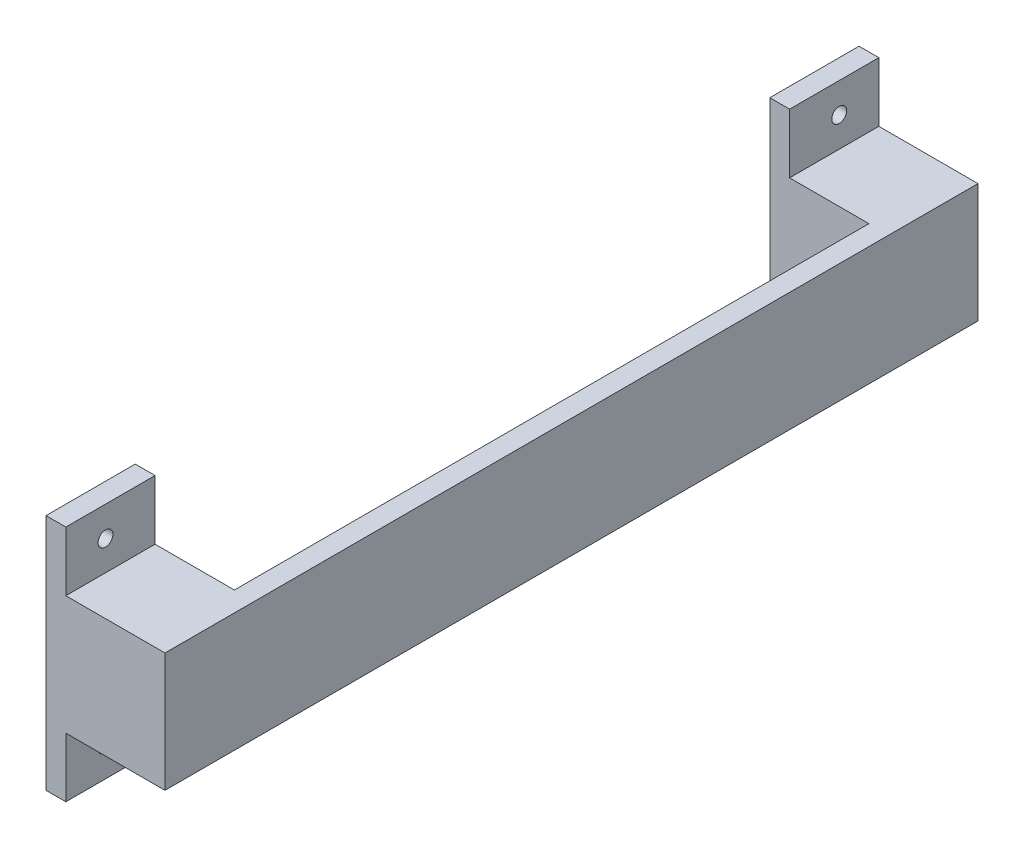
ISO-10303-21;
HEADER;
FILE_DESCRIPTION(('STEP AP214'),'2;1');
FILE_NAME('part.step','',(''),(''),'','','');
FILE_SCHEMA(('AUTOMOTIVE_DESIGN { 1 0 10303 214 1 1 1 1 }'));
ENDSEC;
DATA;
#1=APPLICATION_CONTEXT('core data for automotive mechanical design processes');
#2=APPLICATION_PROTOCOL_DEFINITION('international standard','automotive_design',2000,#1);
#3=PRODUCT_CONTEXT('',#1,'mechanical');
#4=PRODUCT('Part','Part','',(#3));
#5=PRODUCT_RELATED_PRODUCT_CATEGORY('part','',(#4));
#6=PRODUCT_DEFINITION_FORMATION('','',#4);
#7=PRODUCT_DEFINITION_CONTEXT('part definition',#1,'design');
#8=PRODUCT_DEFINITION('design','',#6,#7);
#9=PRODUCT_DEFINITION_SHAPE('','',#8);
#10=(LENGTH_UNIT() NAMED_UNIT(*) SI_UNIT(.MILLI.,.METRE.));
#11=(NAMED_UNIT(*) PLANE_ANGLE_UNIT() SI_UNIT($,.RADIAN.));
#12=(NAMED_UNIT(*) SI_UNIT($,.STERADIAN.) SOLID_ANGLE_UNIT());
#13=UNCERTAINTY_MEASURE_WITH_UNIT(LENGTH_MEASURE(1.E-05),#10,'distance_accuracy_value','');
#14=(GEOMETRIC_REPRESENTATION_CONTEXT(3) GLOBAL_UNCERTAINTY_ASSIGNED_CONTEXT((#13)) GLOBAL_UNIT_ASSIGNED_CONTEXT((#10,
#11,#12)) REPRESENTATION_CONTEXT('',''));
#15=CARTESIAN_POINT('',(0.,0.,0.));
#16=DIRECTION('',(0.,0.,1.));
#17=DIRECTION('',(1.,0.,0.));
#18=AXIS2_PLACEMENT_3D('',#15,#16,#17);
#19=CARTESIAN_POINT('',(0.,0.,0.));
#20=DIRECTION('',(1.,0.,0.));
#21=DIRECTION('',(0.,0.,-1.));
#22=AXIS2_PLACEMENT_3D('',#19,#20,#21);
#23=PLANE('',#22);
#24=CARTESIAN_POINT('',(0.,-14.2875,58.7375));
#25=DIRECTION('',(1.,0.,0.));
#26=DIRECTION('',(0.,1.,0.));
#27=AXIS2_PLACEMENT_3D('',#24,#25,#26);
#28=CIRCLE('',#27,1.190625);
#29=CARTESIAN_POINT('',(0.,-13.096875,58.7375));
#30=VERTEX_POINT('',#29);
#31=EDGE_CURVE('E253',#30,#30,#28,.T.);
#32=ORIENTED_EDGE('',*,*,#31,.T.);
#33=EDGE_LOOP('',(#32));
#34=FACE_BOUND('',#33,.T.);
#35=CARTESIAN_POINT('',(0.,14.2875,58.7375));
#36=DIRECTION('',(1.,0.,0.));
#37=DIRECTION('',(0.,-1.,0.));
#38=AXIS2_PLACEMENT_3D('',#35,#36,#37);
#39=CIRCLE('',#38,1.190625);
#40=CARTESIAN_POINT('',(0.,13.096875,58.7375));
#41=VERTEX_POINT('',#40);
#42=EDGE_CURVE('E271',#41,#41,#39,.T.);
#43=ORIENTED_EDGE('',*,*,#42,.T.);
#44=EDGE_LOOP('',(#43));
#45=FACE_BOUND('',#44,.T.);
#46=DIRECTION('',(0.,0.,1.));
#47=VECTOR('',#46,1.);
#48=CARTESIAN_POINT('',(0.,19.05,-103.319562787666));
#49=LINE('',#48,#47);
#50=CARTESIAN_POINT('',(0.,19.05,50.8));
#51=VERTEX_POINT('',#50);
#52=CARTESIAN_POINT('',(0.,19.05,65.0875));
#53=VERTEX_POINT('',#52);
#54=EDGE_CURVE('E169',#51,#53,#49,.T.);
#55=ORIENTED_EDGE('',*,*,#54,.F.);
#56=DIRECTION('',(0.,-1.,0.));
#57=VECTOR('',#56,1.);
#58=CARTESIAN_POINT('',(0.,19.05,50.8));
#59=LINE('',#58,#57);
#60=CARTESIAN_POINT('',(0.,-19.0500000000001,50.8));
#61=VERTEX_POINT('',#60);
#62=EDGE_CURVE('E226',#51,#61,#59,.T.);
#63=ORIENTED_EDGE('',*,*,#62,.T.);
#64=DIRECTION('',(0.,0.,1.));
#65=VECTOR('',#64,1.);
#66=CARTESIAN_POINT('',(0.,-19.0500000000001,-103.319562787666));
#67=LINE('',#66,#65);
#68=CARTESIAN_POINT('',(0.,-19.0500000000001,65.0875));
#69=VERTEX_POINT('',#68);
#70=EDGE_CURVE('E185',#61,#69,#67,.T.);
#71=ORIENTED_EDGE('',*,*,#70,.T.);
#72=DIRECTION('',(0.,-1.,0.));
#73=VECTOR('',#72,1.);
#74=CARTESIAN_POINT('',(0.,9.525,65.0875));
#75=LINE('',#74,#73);
#76=EDGE_CURVE('E197',#53,#69,#75,.T.);
#77=ORIENTED_EDGE('',*,*,#76,.F.);
#78=EDGE_LOOP('',(#55,#63,#71,#77));
#79=FACE_BOUND('',#78,.T.);
#80=ADVANCED_FACE('F33',(#34,#45,#79),#23,.F.);
#81=CARTESIAN_POINT('',(0.,-19.0500000000001,-103.319562787666));
#82=DIRECTION('',(0.,-1.,0.));
#83=DIRECTION('',(0.,0.,-1.));
#84=AXIS2_PLACEMENT_3D('',#81,#82,#83);
#85=PLANE('',#84);
#86=DIRECTION('',(-1.,0.,0.));
#87=VECTOR('',#86,1.);
#88=CARTESIAN_POINT('',(0.,-19.0500000000001,50.8));
#89=LINE('',#88,#87);
#90=CARTESIAN_POINT('',(3.175,-19.0500000000001,50.8));
#91=VERTEX_POINT('',#90);
#92=EDGE_CURVE('E154',#91,#61,#89,.T.);
#93=ORIENTED_EDGE('',*,*,#92,.F.);
#94=DIRECTION('',(0.,0.,1.));
#95=VECTOR('',#94,1.);
#96=CARTESIAN_POINT('',(3.175,-19.0500000000001,-103.319562787666));
#97=LINE('',#96,#95);
#98=CARTESIAN_POINT('',(3.175,-19.0500000000001,65.0875));
#99=VERTEX_POINT('',#98);
#100=EDGE_CURVE('E183',#91,#99,#97,.T.);
#101=ORIENTED_EDGE('',*,*,#100,.T.);
#102=DIRECTION('',(1.,0.,0.));
#103=VECTOR('',#102,1.);
#104=CARTESIAN_POINT('',(0.,-19.0500000000001,65.0875));
#105=LINE('',#104,#103);
#106=EDGE_CURVE('E250',#69,#99,#105,.T.);
#107=ORIENTED_EDGE('',*,*,#106,.F.);
#108=ORIENTED_EDGE('',*,*,#70,.F.);
#109=EDGE_LOOP('',(#93,#101,#107,#108));
#110=FACE_BOUND('',#109,.T.);
#111=ADVANCED_FACE('F350',(#110),#85,.T.);
#112=CARTESIAN_POINT('',(3.17499999999999,19.05,-103.319562787666));
#113=DIRECTION('',(1.,0.,0.));
#114=DIRECTION('',(0.,1.,0.));
#115=AXIS2_PLACEMENT_3D('',#112,#113,#114);
#116=PLANE('',#115);
#117=DIRECTION('',(0.,-1.,0.));
#118=VECTOR('',#117,1.);
#119=CARTESIAN_POINT('',(3.17499999999999,19.05,50.8));
#120=LINE('',#119,#118);
#121=CARTESIAN_POINT('',(3.175,-9.525,50.8));
#122=VERTEX_POINT('',#121);
#123=EDGE_CURVE('E285',#122,#91,#120,.T.);
#124=ORIENTED_EDGE('',*,*,#123,.F.);
#125=DIRECTION('',(0.,0.,-1.));
#126=VECTOR('',#125,1.);
#127=CARTESIAN_POINT('',(3.175,-9.525,65.0875));
#128=LINE('',#127,#126);
#129=CARTESIAN_POINT('',(3.175,-9.52499999999999,65.0875));
#130=VERTEX_POINT('',#129);
#131=EDGE_CURVE('E217',#130,#122,#128,.T.);
#132=ORIENTED_EDGE('',*,*,#131,.F.);
#133=DIRECTION('',(0.,1.,0.));
#134=VECTOR('',#133,1.);
#135=CARTESIAN_POINT('',(3.17499999999999,19.05,65.0875));
#136=LINE('',#135,#134);
#137=EDGE_CURVE('E244',#99,#130,#136,.T.);
#138=ORIENTED_EDGE('',*,*,#137,.F.);
#139=ORIENTED_EDGE('',*,*,#100,.F.);
#140=EDGE_LOOP('',(#124,#132,#138,#139));
#141=FACE_BOUND('',#140,.T.);
#142=CARTESIAN_POINT('',(3.175,-14.2875,58.7375));
#143=DIRECTION('',(1.,0.,0.));
#144=DIRECTION('',(0.,1.,0.));
#145=AXIS2_PLACEMENT_3D('',#142,#143,#144);
#146=CIRCLE('',#145,1.190625);
#147=CARTESIAN_POINT('',(3.175,-13.096875,58.7375));
#148=VERTEX_POINT('',#147);
#149=EDGE_CURVE('E256',#148,#148,#146,.T.);
#150=ORIENTED_EDGE('',*,*,#149,.F.);
#151=EDGE_LOOP('',(#150));
#152=FACE_BOUND('',#151,.T.);
#153=ADVANCED_FACE('F330',(#141,#152),#116,.T.);
#154=DIRECTION('',(0.,-1.,0.));
#155=VECTOR('',#154,1.);
#156=CARTESIAN_POINT('',(3.17499999999999,19.05,50.8));
#157=LINE('',#156,#155);
#158=CARTESIAN_POINT('',(3.17499999999999,19.05,50.8));
#159=VERTEX_POINT('',#158);
#160=CARTESIAN_POINT('',(3.175,9.525,50.8));
#161=VERTEX_POINT('',#160);
#162=EDGE_CURVE('E223',#159,#161,#157,.T.);
#163=ORIENTED_EDGE('',*,*,#162,.F.);
#164=DIRECTION('',(0.,0.,1.));
#165=VECTOR('',#164,1.);
#166=CARTESIAN_POINT('',(3.17499999999999,19.05,-103.319562787666));
#167=LINE('',#166,#165);
#168=CARTESIAN_POINT('',(3.17499999999999,19.05,65.0875));
#169=VERTEX_POINT('',#168);
#170=EDGE_CURVE('E179',#159,#169,#167,.T.);
#171=ORIENTED_EDGE('',*,*,#170,.T.);
#172=CARTESIAN_POINT('',(3.17500000000001,9.525,65.0875));
#173=VERTEX_POINT('',#172);
#174=EDGE_CURVE('E246',#173,#169,#136,.T.);
#175=ORIENTED_EDGE('',*,*,#174,.F.);
#176=DIRECTION('',(0.,0.,1.));
#177=VECTOR('',#176,1.);
#178=CARTESIAN_POINT('',(3.175,9.525,65.0875));
#179=LINE('',#178,#177);
#180=EDGE_CURVE('E189',#161,#173,#179,.T.);
#181=ORIENTED_EDGE('',*,*,#180,.F.);
#182=EDGE_LOOP('',(#163,#171,#175,#181));
#183=FACE_BOUND('',#182,.T.);
#184=CARTESIAN_POINT('',(3.17499999999999,14.2875,58.7375));
#185=DIRECTION('',(1.,0.,0.));
#186=DIRECTION('',(0.,-1.,0.));
#187=AXIS2_PLACEMENT_3D('',#184,#185,#186);
#188=CIRCLE('',#187,1.190625);
#189=CARTESIAN_POINT('',(3.17499999999999,13.096875,58.7375));
#190=VERTEX_POINT('',#189);
#191=EDGE_CURVE('E274',#190,#190,#188,.T.);
#192=ORIENTED_EDGE('',*,*,#191,.F.);
#193=EDGE_LOOP('',(#192));
#194=FACE_BOUND('',#193,.T.);
#195=ADVANCED_FACE('F232',(#183,#194),#116,.T.);
#196=CARTESIAN_POINT('',(0.,19.05,-103.319562787666));
#197=DIRECTION('',(0.,1.,0.));
#198=DIRECTION('',(0.,0.,1.));
#199=AXIS2_PLACEMENT_3D('',#196,#197,#198);
#200=PLANE('',#199);
#201=DIRECTION('',(1.,0.,0.));
#202=VECTOR('',#201,1.);
#203=CARTESIAN_POINT('',(0.,19.05,50.8));
#204=LINE('',#203,#202);
#205=EDGE_CURVE('E41',#51,#159,#204,.T.);
#206=ORIENTED_EDGE('',*,*,#205,.F.);
#207=ORIENTED_EDGE('',*,*,#54,.T.);
#208=DIRECTION('',(-1.,0.,0.));
#209=VECTOR('',#208,1.);
#210=CARTESIAN_POINT('',(0.,19.05,65.0875));
#211=LINE('',#210,#209);
#212=EDGE_CURVE('E176',#169,#53,#211,.T.);
#213=ORIENTED_EDGE('',*,*,#212,.F.);
#214=ORIENTED_EDGE('',*,*,#170,.F.);
#215=EDGE_LOOP('',(#206,#207,#213,#214));
#216=FACE_BOUND('',#215,.T.);
#217=ADVANCED_FACE('F240',(#216),#200,.T.);
#218=CARTESIAN_POINT('',(19.05,9.525,-65.0875));
#219=DIRECTION('',(0.,0.,1.));
#220=DIRECTION('',(0.,-1.,0.));
#221=AXIS2_PLACEMENT_3D('',#218,#219,#220);
#222=PLANE('',#221);
#223=DIRECTION('',(-1.,0.,0.));
#224=VECTOR('',#223,1.);
#225=CARTESIAN_POINT('',(19.05,-9.525,-65.0875));
#226=LINE('',#225,#224);
#227=CARTESIAN_POINT('',(19.05,-9.525,-65.0875));
#228=VERTEX_POINT('',#227);
#229=CARTESIAN_POINT('',(3.175,-9.525,-65.0875));
#230=VERTEX_POINT('',#229);
#231=EDGE_CURVE('E203',#228,#230,#226,.T.);
#232=ORIENTED_EDGE('',*,*,#231,.T.);
#233=DIRECTION('',(0.,-1.,0.));
#234=VECTOR('',#233,1.);
#235=CARTESIAN_POINT('',(3.17499999999999,19.05,-65.0875));
#236=LINE('',#235,#234);
#237=CARTESIAN_POINT('',(3.175,-19.0500000000001,-65.0875));
#238=VERTEX_POINT('',#237);
#239=EDGE_CURVE('E168',#230,#238,#236,.T.);
#240=ORIENTED_EDGE('',*,*,#239,.T.);
#241=DIRECTION('',(-1.,0.,0.));
#242=VECTOR('',#241,1.);
#243=CARTESIAN_POINT('',(0.,-19.0500000000001,-65.0875));
#244=LINE('',#243,#242);
#245=CARTESIAN_POINT('',(0.,-19.0500000000001,-65.0875));
#246=VERTEX_POINT('',#245);
#247=EDGE_CURVE('E186',#238,#246,#244,.T.);
#248=ORIENTED_EDGE('',*,*,#247,.T.);
#249=DIRECTION('',(0.,1.,0.));
#250=VECTOR('',#249,1.);
#251=CARTESIAN_POINT('',(0.,9.525,-65.0875));
#252=LINE('',#251,#250);
#253=CARTESIAN_POINT('',(0.,19.05,-65.0875));
#254=VERTEX_POINT('',#253);
#255=EDGE_CURVE('E192',#246,#254,#252,.T.);
#256=ORIENTED_EDGE('',*,*,#255,.T.);
#257=DIRECTION('',(1.,0.,0.));
#258=VECTOR('',#257,1.);
#259=CARTESIAN_POINT('',(0.,19.05,-65.0875));
#260=LINE('',#259,#258);
#261=CARTESIAN_POINT('',(3.17499999999999,19.05,-65.0875));
#262=VERTEX_POINT('',#261);
#263=EDGE_CURVE('E167',#254,#262,#260,.T.);
#264=ORIENTED_EDGE('',*,*,#263,.T.);
#265=CARTESIAN_POINT('',(3.17500000000001,9.525,-65.0875));
#266=VERTEX_POINT('',#265);
#267=EDGE_CURVE('E171',#262,#266,#236,.T.);
#268=ORIENTED_EDGE('',*,*,#267,.T.);
#269=DIRECTION('',(-1.,0.,0.));
#270=VECTOR('',#269,1.);
#271=CARTESIAN_POINT('',(19.05,9.525,-65.0875));
#272=LINE('',#271,#270);
#273=CARTESIAN_POINT('',(19.05,9.525,-65.0875));
#274=VERTEX_POINT('',#273);
#275=EDGE_CURVE('E56',#274,#266,#272,.T.);
#276=ORIENTED_EDGE('',*,*,#275,.F.);
#277=DIRECTION('',(0.,1.,0.));
#278=VECTOR('',#277,1.);
#279=CARTESIAN_POINT('',(19.05,9.525,-65.0875));
#280=LINE('',#279,#278);
#281=EDGE_CURVE('E193',#228,#274,#280,.T.);
#282=ORIENTED_EDGE('',*,*,#281,.F.);
#283=EDGE_LOOP('',(#232,#240,#248,#256,#264,#268,#276,#282));
#284=FACE_BOUND('',#283,.T.);
#285=ADVANCED_FACE('F35',(#284),#222,.F.);
#286=CARTESIAN_POINT('',(19.05,9.525,65.0875));
#287=DIRECTION('',(0.,-1.,0.));
#288=DIRECTION('',(0.,0.,-1.));
#289=AXIS2_PLACEMENT_3D('',#286,#287,#288);
#290=PLANE('',#289);
#291=DIRECTION('',(0.,0.,1.));
#292=VECTOR('',#291,1.);
#293=CARTESIAN_POINT('',(15.875,9.525,65.0875));
#294=LINE('',#293,#292);
#295=CARTESIAN_POINT('',(15.875,9.52500000000001,-50.8));
#296=VERTEX_POINT('',#295);
#297=CARTESIAN_POINT('',(15.875,9.52500000000001,50.8));
#298=VERTEX_POINT('',#297);
#299=EDGE_CURVE('E277',#296,#298,#294,.T.);
#300=ORIENTED_EDGE('',*,*,#299,.T.);
#301=DIRECTION('',(-1.,0.,0.));
#302=VECTOR('',#301,1.);
#303=CARTESIAN_POINT('',(19.05,9.525,50.8));
#304=LINE('',#303,#302);
#305=EDGE_CURVE('E236',#298,#161,#304,.T.);
#306=ORIENTED_EDGE('',*,*,#305,.T.);
#307=ORIENTED_EDGE('',*,*,#180,.T.);
#308=DIRECTION('',(-1.,0.,0.));
#309=VECTOR('',#308,1.);
#310=CARTESIAN_POINT('',(19.05,9.525,65.0875));
#311=LINE('',#310,#309);
#312=CARTESIAN_POINT('',(19.05,9.525,65.0875));
#313=VERTEX_POINT('',#312);
#314=EDGE_CURVE('E212',#313,#173,#311,.T.);
#315=ORIENTED_EDGE('',*,*,#314,.F.);
#316=DIRECTION('',(0.,0.,1.));
#317=VECTOR('',#316,1.);
#318=CARTESIAN_POINT('',(19.05,9.525,65.0875));
#319=LINE('',#318,#317);
#320=EDGE_CURVE('E196',#274,#313,#319,.T.);
#321=ORIENTED_EDGE('',*,*,#320,.F.);
#322=ORIENTED_EDGE('',*,*,#275,.T.);
#323=CARTESIAN_POINT('',(3.175,9.525,-50.8));
#324=VERTEX_POINT('',#323);
#325=EDGE_CURVE('E190',#266,#324,#179,.T.);
#326=ORIENTED_EDGE('',*,*,#325,.T.);
#327=DIRECTION('',(1.,0.,0.));
#328=VECTOR('',#327,1.);
#329=CARTESIAN_POINT('',(19.05,9.525,-50.8));
#330=LINE('',#329,#328);
#331=EDGE_CURVE('E292',#324,#296,#330,.T.);
#332=ORIENTED_EDGE('',*,*,#331,.T.);
#333=EDGE_LOOP('',(#300,#306,#307,#315,#321,#322,#326,#332));
#334=FACE_BOUND('',#333,.T.);
#335=ADVANCED_FACE('F323',(#334),#290,.F.);
#336=CARTESIAN_POINT('',(19.05,9.525,65.0875));
#337=DIRECTION('',(0.,0.,-1.));
#338=DIRECTION('',(0.,1.,0.));
#339=AXIS2_PLACEMENT_3D('',#336,#337,#338);
#340=PLANE('',#339);
#341=ORIENTED_EDGE('',*,*,#314,.T.);
#342=ORIENTED_EDGE('',*,*,#174,.T.);
#343=ORIENTED_EDGE('',*,*,#212,.T.);
#344=ORIENTED_EDGE('',*,*,#76,.T.);
#345=ORIENTED_EDGE('',*,*,#106,.T.);
#346=ORIENTED_EDGE('',*,*,#137,.T.);
#347=DIRECTION('',(-1.,0.,0.));
#348=VECTOR('',#347,1.);
#349=CARTESIAN_POINT('',(19.05,-9.525,65.0875));
#350=LINE('',#349,#348);
#351=CARTESIAN_POINT('',(19.05,-9.525,65.0875));
#352=VERTEX_POINT('',#351);
#353=EDGE_CURVE('E209',#352,#130,#350,.T.);
#354=ORIENTED_EDGE('',*,*,#353,.F.);
#355=DIRECTION('',(0.,-1.,0.));
#356=VECTOR('',#355,1.);
#357=CARTESIAN_POINT('',(19.05,9.525,65.0875));
#358=LINE('',#357,#356);
#359=EDGE_CURVE('E199',#313,#352,#358,.T.);
#360=ORIENTED_EDGE('',*,*,#359,.F.);
#361=EDGE_LOOP('',(#341,#342,#343,#344,#345,#346,#354,#360));
#362=FACE_BOUND('',#361,.T.);
#363=ADVANCED_FACE('F429',(#362),#340,.F.);
#364=CARTESIAN_POINT('',(19.05,-9.525,65.0875));
#365=DIRECTION('',(0.,1.,0.));
#366=DIRECTION('',(0.,0.,1.));
#367=AXIS2_PLACEMENT_3D('',#364,#365,#366);
#368=PLANE('',#367);
#369=ORIENTED_EDGE('',*,*,#131,.T.);
#370=DIRECTION('',(1.,0.,0.));
#371=VECTOR('',#370,1.);
#372=CARTESIAN_POINT('',(19.05,-9.525,50.8));
#373=LINE('',#372,#371);
#374=CARTESIAN_POINT('',(15.875,-9.52499999999999,50.8));
#375=VERTEX_POINT('',#374);
#376=EDGE_CURVE('E282',#122,#375,#373,.T.);
#377=ORIENTED_EDGE('',*,*,#376,.T.);
#378=DIRECTION('',(0.,0.,-1.));
#379=VECTOR('',#378,1.);
#380=CARTESIAN_POINT('',(15.875,-9.525,65.0875));
#381=LINE('',#380,#379);
#382=CARTESIAN_POINT('',(15.875,-9.52499999999999,-50.8));
#383=VERTEX_POINT('',#382);
#384=EDGE_CURVE('E11',#375,#383,#381,.T.);
#385=ORIENTED_EDGE('',*,*,#384,.T.);
#386=DIRECTION('',(-1.,0.,0.));
#387=VECTOR('',#386,1.);
#388=CARTESIAN_POINT('',(19.05,-9.525,-50.8));
#389=LINE('',#388,#387);
#390=CARTESIAN_POINT('',(3.175,-9.525,-50.8));
#391=VERTEX_POINT('',#390);
#392=EDGE_CURVE('E237',#383,#391,#389,.T.);
#393=ORIENTED_EDGE('',*,*,#392,.T.);
#394=EDGE_CURVE('E216',#391,#230,#128,.T.);
#395=ORIENTED_EDGE('',*,*,#394,.T.);
#396=ORIENTED_EDGE('',*,*,#231,.F.);
#397=DIRECTION('',(0.,0.,-1.));
#398=VECTOR('',#397,1.);
#399=CARTESIAN_POINT('',(19.05,-9.525,65.0875));
#400=LINE('',#399,#398);
#401=EDGE_CURVE('E201',#352,#228,#400,.T.);
#402=ORIENTED_EDGE('',*,*,#401,.F.);
#403=ORIENTED_EDGE('',*,*,#353,.T.);
#404=EDGE_LOOP('',(#369,#377,#385,#393,#395,#396,#402,#403));
#405=FACE_BOUND('',#404,.T.);
#406=ADVANCED_FACE('F319',(#405),#368,.F.);
#407=CARTESIAN_POINT('',(19.05,0.,0.));
#408=DIRECTION('',(1.,0.,0.));
#409=DIRECTION('',(0.,0.,-1.));
#410=AXIS2_PLACEMENT_3D('',#407,#408,#409);
#411=PLANE('',#410);
#412=ORIENTED_EDGE('',*,*,#281,.T.);
#413=ORIENTED_EDGE('',*,*,#320,.T.);
#414=ORIENTED_EDGE('',*,*,#359,.T.);
#415=ORIENTED_EDGE('',*,*,#401,.T.);
#416=EDGE_LOOP('',(#412,#413,#414,#415));
#417=FACE_BOUND('',#416,.T.);
#418=ADVANCED_FACE('F362',(#417),#411,.T.);
#419=CARTESIAN_POINT('',(0.,14.2875,-58.7374999999999));
#420=DIRECTION('',(1.,0.,0.));
#421=DIRECTION('',(0.,1.,0.));
#422=AXIS2_PLACEMENT_3D('',#419,#420,#421);
#423=CIRCLE('',#422,1.190625);
#424=CARTESIAN_POINT('',(0.,15.478125,-58.7374999999999));
#425=VERTEX_POINT('',#424);
#426=EDGE_CURVE('E265',#425,#425,#423,.T.);
#427=ORIENTED_EDGE('',*,*,#426,.T.);
#428=EDGE_LOOP('',(#427));
#429=FACE_BOUND('',#428,.T.);
#430=CARTESIAN_POINT('',(0.,-14.2875,-58.7375));
#431=DIRECTION('',(1.,0.,0.));
#432=DIRECTION('',(0.,-1.,0.));
#433=AXIS2_PLACEMENT_3D('',#430,#431,#432);
#434=CIRCLE('',#433,1.190625);
#435=CARTESIAN_POINT('',(0.,-15.478125,-58.7375));
#436=VERTEX_POINT('',#435);
#437=EDGE_CURVE('E259',#436,#436,#434,.T.);
#438=ORIENTED_EDGE('',*,*,#437,.T.);
#439=EDGE_LOOP('',(#438));
#440=FACE_BOUND('',#439,.T.);
#441=CARTESIAN_POINT('',(0.,-19.0500000000001,-50.8));
#442=VERTEX_POINT('',#441);
#443=EDGE_CURVE('E162',#246,#442,#67,.T.);
#444=ORIENTED_EDGE('',*,*,#443,.T.);
#445=DIRECTION('',(0.,-1.,0.));
#446=VECTOR('',#445,1.);
#447=CARTESIAN_POINT('',(0.,19.05,-50.8));
#448=LINE('',#447,#446);
#449=CARTESIAN_POINT('',(0.,19.05,-50.8));
#450=VERTEX_POINT('',#449);
#451=EDGE_CURVE('E148',#450,#442,#448,.T.);
#452=ORIENTED_EDGE('',*,*,#451,.F.);
#453=EDGE_CURVE('E160',#254,#450,#49,.T.);
#454=ORIENTED_EDGE('',*,*,#453,.F.);
#455=ORIENTED_EDGE('',*,*,#255,.F.);
#456=EDGE_LOOP('',(#444,#452,#454,#455));
#457=FACE_BOUND('',#456,.T.);
#458=ADVANCED_FACE('F159',(#429,#440,#457),#23,.F.);
#459=DIRECTION('',(1.,0.,0.));
#460=VECTOR('',#459,1.);
#461=CARTESIAN_POINT('',(0.,-19.0500000000001,-50.8));
#462=LINE('',#461,#460);
#463=CARTESIAN_POINT('',(3.175,-19.0500000000001,-50.8));
#464=VERTEX_POINT('',#463);
#465=EDGE_CURVE('E303',#442,#464,#462,.T.);
#466=ORIENTED_EDGE('',*,*,#465,.F.);
#467=ORIENTED_EDGE('',*,*,#443,.F.);
#468=ORIENTED_EDGE('',*,*,#247,.F.);
#469=EDGE_CURVE('E180',#238,#464,#97,.T.);
#470=ORIENTED_EDGE('',*,*,#469,.T.);
#471=EDGE_LOOP('',(#466,#467,#468,#470));
#472=FACE_BOUND('',#471,.T.);
#473=ADVANCED_FACE('F313',(#472),#85,.T.);
#474=DIRECTION('',(0.,1.,0.));
#475=VECTOR('',#474,1.);
#476=CARTESIAN_POINT('',(3.17499999999999,19.05,-50.8));
#477=LINE('',#476,#475);
#478=EDGE_CURVE('E290',#464,#391,#477,.T.);
#479=ORIENTED_EDGE('',*,*,#478,.F.);
#480=ORIENTED_EDGE('',*,*,#469,.F.);
#481=ORIENTED_EDGE('',*,*,#239,.F.);
#482=ORIENTED_EDGE('',*,*,#394,.F.);
#483=EDGE_LOOP('',(#479,#480,#481,#482));
#484=FACE_BOUND('',#483,.T.);
#485=CARTESIAN_POINT('',(3.175,-14.2875,-58.7375));
#486=DIRECTION('',(1.,0.,0.));
#487=DIRECTION('',(0.,-1.,0.));
#488=AXIS2_PLACEMENT_3D('',#485,#486,#487);
#489=CIRCLE('',#488,1.190625);
#490=CARTESIAN_POINT('',(3.175,-15.478125,-58.7375));
#491=VERTEX_POINT('',#490);
#492=EDGE_CURVE('E262',#491,#491,#489,.T.);
#493=ORIENTED_EDGE('',*,*,#492,.F.);
#494=EDGE_LOOP('',(#493));
#495=FACE_BOUND('',#494,.T.);
#496=ADVANCED_FACE('F309',(#484,#495),#116,.T.);
#497=DIRECTION('',(0.,1.,0.));
#498=VECTOR('',#497,1.);
#499=CARTESIAN_POINT('',(3.17499999999999,19.05,-50.8));
#500=LINE('',#499,#498);
#501=CARTESIAN_POINT('',(3.17499999999999,19.05,-50.8));
#502=VERTEX_POINT('',#501);
#503=EDGE_CURVE('E48',#324,#502,#500,.T.);
#504=ORIENTED_EDGE('',*,*,#503,.F.);
#505=ORIENTED_EDGE('',*,*,#325,.F.);
#506=ORIENTED_EDGE('',*,*,#267,.F.);
#507=EDGE_CURVE('E173',#262,#502,#167,.T.);
#508=ORIENTED_EDGE('',*,*,#507,.T.);
#509=EDGE_LOOP('',(#504,#505,#506,#508));
#510=FACE_BOUND('',#509,.T.);
#511=CARTESIAN_POINT('',(3.17499999999999,14.2875,-58.7374999999999));
#512=DIRECTION('',(1.,0.,0.));
#513=DIRECTION('',(0.,1.,0.));
#514=AXIS2_PLACEMENT_3D('',#511,#512,#513);
#515=CIRCLE('',#514,1.190625);
#516=CARTESIAN_POINT('',(3.17499999999999,15.478125,-58.7374999999999));
#517=VERTEX_POINT('',#516);
#518=EDGE_CURVE('E268',#517,#517,#515,.T.);
#519=ORIENTED_EDGE('',*,*,#518,.F.);
#520=EDGE_LOOP('',(#519));
#521=FACE_BOUND('',#520,.T.);
#522=ADVANCED_FACE('F325',(#510,#521),#116,.T.);
#523=DIRECTION('',(1.,0.,0.));
#524=VECTOR('',#523,1.);
#525=CARTESIAN_POINT('',(0.,19.05,-50.8));
#526=LINE('',#525,#524);
#527=EDGE_CURVE('E144',#450,#502,#526,.T.);
#528=ORIENTED_EDGE('',*,*,#527,.T.);
#529=ORIENTED_EDGE('',*,*,#507,.F.);
#530=ORIENTED_EDGE('',*,*,#263,.F.);
#531=ORIENTED_EDGE('',*,*,#453,.T.);
#532=EDGE_LOOP('',(#528,#529,#530,#531));
#533=FACE_BOUND('',#532,.T.);
#534=ADVANCED_FACE('F166',(#533),#200,.T.);
#535=CARTESIAN_POINT('',(0.,-14.2875,58.7375));
#536=DIRECTION('',(1.,0.,0.));
#537=DIRECTION('',(0.,1.,0.));
#538=AXIS2_PLACEMENT_3D('',#535,#536,#537);
#539=CYLINDRICAL_SURFACE('',#538,1.190625);
#540=ORIENTED_EDGE('',*,*,#31,.F.);
#541=EDGE_LOOP('',(#540));
#542=FACE_BOUND('',#541,.T.);
#543=ORIENTED_EDGE('',*,*,#149,.T.);
#544=EDGE_LOOP('',(#543));
#545=FACE_BOUND('',#544,.T.);
#546=ADVANCED_FACE('F345',(#542,#545),#539,.F.);
#547=CARTESIAN_POINT('',(0.,-14.2875,-58.7375));
#548=DIRECTION('',(1.,0.,0.));
#549=DIRECTION('',(0.,1.,0.));
#550=AXIS2_PLACEMENT_3D('',#547,#548,#549);
#551=CYLINDRICAL_SURFACE('',#550,1.190625);
#552=ORIENTED_EDGE('',*,*,#437,.F.);
#553=EDGE_LOOP('',(#552));
#554=FACE_BOUND('',#553,.T.);
#555=ORIENTED_EDGE('',*,*,#492,.T.);
#556=EDGE_LOOP('',(#555));
#557=FACE_BOUND('',#556,.T.);
#558=ADVANCED_FACE('F336',(#554,#557),#551,.F.);
#559=CARTESIAN_POINT('',(0.,14.2875,-58.7374999999999));
#560=DIRECTION('',(1.,0.,0.));
#561=DIRECTION('',(0.,1.,0.));
#562=AXIS2_PLACEMENT_3D('',#559,#560,#561);
#563=CYLINDRICAL_SURFACE('',#562,1.190625);
#564=ORIENTED_EDGE('',*,*,#426,.F.);
#565=EDGE_LOOP('',(#564));
#566=FACE_BOUND('',#565,.T.);
#567=ORIENTED_EDGE('',*,*,#518,.T.);
#568=EDGE_LOOP('',(#567));
#569=FACE_BOUND('',#568,.T.);
#570=ADVANCED_FACE('F333',(#566,#569),#563,.F.);
#571=CARTESIAN_POINT('',(0.,14.2875,58.7375));
#572=DIRECTION('',(1.,0.,0.));
#573=DIRECTION('',(0.,1.,0.));
#574=AXIS2_PLACEMENT_3D('',#571,#572,#573);
#575=CYLINDRICAL_SURFACE('',#574,1.190625);
#576=ORIENTED_EDGE('',*,*,#42,.F.);
#577=EDGE_LOOP('',(#576));
#578=FACE_BOUND('',#577,.T.);
#579=ORIENTED_EDGE('',*,*,#191,.T.);
#580=EDGE_LOOP('',(#579));
#581=FACE_BOUND('',#580,.T.);
#582=ADVANCED_FACE('F335',(#578,#581),#575,.F.);
#583=CARTESIAN_POINT('',(15.875,19.05,50.8));
#584=DIRECTION('',(1.,0.,0.));
#585=DIRECTION('',(0.,0.,-1.));
#586=AXIS2_PLACEMENT_3D('',#583,#584,#585);
#587=PLANE('',#586);
#588=DIRECTION('',(0.,-1.,0.));
#589=VECTOR('',#588,1.);
#590=CARTESIAN_POINT('',(15.875,19.05,-50.8));
#591=LINE('',#590,#589);
#592=EDGE_CURVE('E163',#296,#383,#591,.T.);
#593=ORIENTED_EDGE('',*,*,#592,.T.);
#594=ORIENTED_EDGE('',*,*,#384,.F.);
#595=DIRECTION('',(0.,-1.,0.));
#596=VECTOR('',#595,1.);
#597=CARTESIAN_POINT('',(15.875,19.05,50.8));
#598=LINE('',#597,#596);
#599=EDGE_CURVE('E298',#298,#375,#598,.T.);
#600=ORIENTED_EDGE('',*,*,#599,.F.);
#601=ORIENTED_EDGE('',*,*,#299,.F.);
#602=EDGE_LOOP('',(#593,#594,#600,#601));
#603=FACE_BOUND('',#602,.T.);
#604=ADVANCED_FACE('F321',(#603),#587,.F.);
#605=CARTESIAN_POINT('',(0.,19.05,50.8));
#606=DIRECTION('',(0.,0.,1.));
#607=DIRECTION('',(1.,0.,0.));
#608=AXIS2_PLACEMENT_3D('',#605,#606,#607);
#609=PLANE('',#608);
#610=ORIENTED_EDGE('',*,*,#123,.T.);
#611=ORIENTED_EDGE('',*,*,#92,.T.);
#612=ORIENTED_EDGE('',*,*,#62,.F.);
#613=ORIENTED_EDGE('',*,*,#205,.T.);
#614=ORIENTED_EDGE('',*,*,#162,.T.);
#615=ORIENTED_EDGE('',*,*,#305,.F.);
#616=ORIENTED_EDGE('',*,*,#599,.T.);
#617=ORIENTED_EDGE('',*,*,#376,.F.);
#618=EDGE_LOOP('',(#610,#611,#612,#613,#614,#615,#616,#617));
#619=FACE_BOUND('',#618,.T.);
#620=ADVANCED_FACE('F222',(#619),#609,.F.);
#621=CARTESIAN_POINT('',(0.,19.05,-50.8));
#622=DIRECTION('',(0.,0.,-1.));
#623=DIRECTION('',(-1.,0.,0.));
#624=AXIS2_PLACEMENT_3D('',#621,#622,#623);
#625=PLANE('',#624);
#626=ORIENTED_EDGE('',*,*,#592,.F.);
#627=ORIENTED_EDGE('',*,*,#331,.F.);
#628=ORIENTED_EDGE('',*,*,#503,.T.);
#629=ORIENTED_EDGE('',*,*,#527,.F.);
#630=ORIENTED_EDGE('',*,*,#451,.T.);
#631=ORIENTED_EDGE('',*,*,#465,.T.);
#632=ORIENTED_EDGE('',*,*,#478,.T.);
#633=ORIENTED_EDGE('',*,*,#392,.F.);
#634=EDGE_LOOP('',(#626,#627,#628,#629,#630,#631,#632,#633));
#635=FACE_BOUND('',#634,.T.);
#636=ADVANCED_FACE('F147',(#635),#625,.F.);
#637=CLOSED_SHELL('',(#80,#111,#153,#195,#217,#285,#335,#363,#406,#418,#458,#473,#496,#522,#534,
#546,#558,#570,#582,#604,#620,#636));
#638=MANIFOLD_SOLID_BREP('B2',#637);
#639=ADVANCED_BREP_SHAPE_REPRESENTATION('',(#18,#638),#14);
#640=SHAPE_DEFINITION_REPRESENTATION(#9,#639);
ENDSEC;
END-ISO-10303-21;
